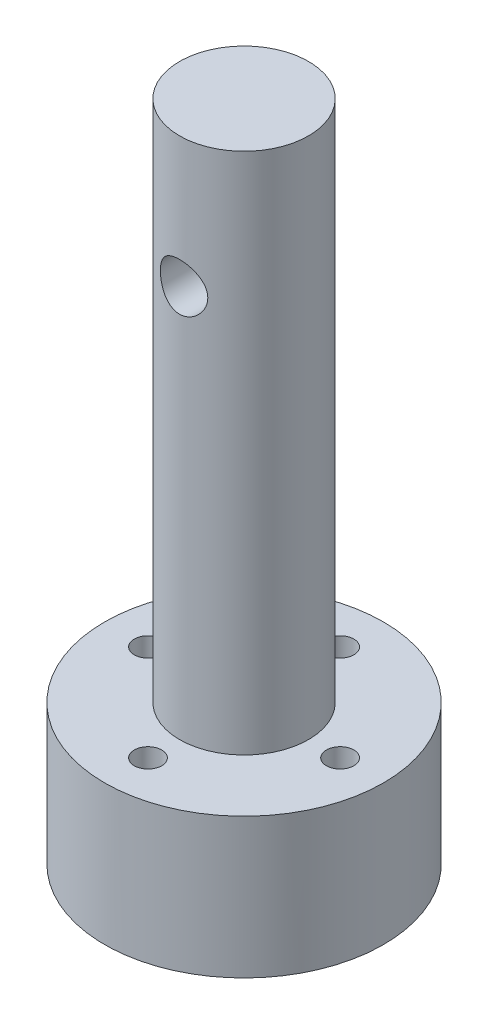
ISO-10303-21;
HEADER;
FILE_DESCRIPTION(('STEP AP214'),'2;1');
FILE_NAME('part.step','',(''),(''),'','','');
FILE_SCHEMA(('AUTOMOTIVE_DESIGN { 1 0 10303 214 1 1 1 1 }'));
ENDSEC;
DATA;
#1=APPLICATION_CONTEXT('core data for automotive mechanical design processes');
#2=APPLICATION_PROTOCOL_DEFINITION('international standard','automotive_design',2000,#1);
#3=PRODUCT_CONTEXT('',#1,'mechanical');
#4=PRODUCT('Part','Part','',(#3));
#5=PRODUCT_RELATED_PRODUCT_CATEGORY('part','',(#4));
#6=PRODUCT_DEFINITION_FORMATION('','',#4);
#7=PRODUCT_DEFINITION_CONTEXT('part definition',#1,'design');
#8=PRODUCT_DEFINITION('design','',#6,#7);
#9=PRODUCT_DEFINITION_SHAPE('','',#8);
#10=(LENGTH_UNIT() NAMED_UNIT(*) SI_UNIT(.MILLI.,.METRE.));
#11=(NAMED_UNIT(*) PLANE_ANGLE_UNIT() SI_UNIT($,.RADIAN.));
#12=(NAMED_UNIT(*) SI_UNIT($,.STERADIAN.) SOLID_ANGLE_UNIT());
#13=UNCERTAINTY_MEASURE_WITH_UNIT(LENGTH_MEASURE(1.E-05),#10,'distance_accuracy_value','');
#14=(GEOMETRIC_REPRESENTATION_CONTEXT(3) GLOBAL_UNCERTAINTY_ASSIGNED_CONTEXT((#13)) GLOBAL_UNIT_ASSIGNED_CONTEXT((#10,
#11,#12)) REPRESENTATION_CONTEXT('',''));
#15=CARTESIAN_POINT('',(0.,0.,0.));
#16=DIRECTION('',(0.,0.,1.));
#17=DIRECTION('',(1.,0.,0.));
#18=AXIS2_PLACEMENT_3D('',#15,#16,#17);
#19=CARTESIAN_POINT('',(0.,19.05,0.));
#20=DIRECTION('',(0.,-1.,0.));
#21=DIRECTION('',(0.,0.,-1.));
#22=AXIS2_PLACEMENT_3D('',#19,#20,#21);
#23=CYLINDRICAL_SURFACE('',#22,10.16);
#24=CARTESIAN_POINT('',(0.,19.05,0.));
#25=DIRECTION('',(0.,1.,0.));
#26=DIRECTION('',(0.,0.,1.));
#27=AXIS2_PLACEMENT_3D('',#24,#25,#26);
#28=CIRCLE('',#27,10.16);
#29=CARTESIAN_POINT('',(0.,19.05,10.16));
#30=VERTEX_POINT('',#29);
#31=EDGE_CURVE('E10',#30,#30,#28,.T.);
#32=ORIENTED_EDGE('',*,*,#31,.F.);
#33=EDGE_LOOP('',(#32));
#34=FACE_BOUND('',#33,.T.);
#35=CARTESIAN_POINT('',(0.,8.842000096,0.));
#36=DIRECTION('',(0.,-1.,0.));
#37=DIRECTION('',(0.,0.,-1.));
#38=AXIS2_PLACEMENT_3D('',#35,#36,#37);
#39=CIRCLE('',#38,10.16);
#40=CARTESIAN_POINT('',(0.,8.842000096,-10.16));
#41=VERTEX_POINT('',#40);
#42=EDGE_CURVE('E61',#41,#41,#39,.T.);
#43=ORIENTED_EDGE('',*,*,#42,.F.);
#44=EDGE_LOOP('',(#43));
#45=FACE_BOUND('',#44,.T.);
#46=ADVANCED_FACE('F37',(#34,#45),#23,.T.);
#47=CARTESIAN_POINT('',(6.99999997,19.05,0.));
#48=DIRECTION('',(0.,-1.,0.));
#49=DIRECTION('',(0.,0.,-1.));
#50=AXIS2_PLACEMENT_3D('',#47,#48,#49);
#51=CYLINDRICAL_SURFACE('',#50,1.000000032);
#52=CARTESIAN_POINT('',(6.99999997,19.05,0.));
#53=DIRECTION('',(0.,1.,0.));
#54=DIRECTION('',(0.,0.,1.));
#55=AXIS2_PLACEMENT_3D('',#52,#53,#54);
#56=CIRCLE('',#55,1.000000032);
#57=CARTESIAN_POINT('',(6.99999997,19.05,1.000000032));
#58=VERTEX_POINT('',#57);
#59=EDGE_CURVE('E49',#58,#58,#56,.T.);
#60=ORIENTED_EDGE('',*,*,#59,.T.);
#61=EDGE_LOOP('',(#60));
#62=FACE_BOUND('',#61,.T.);
#63=CARTESIAN_POINT('',(6.99999997,8.842000096,0.));
#64=DIRECTION('',(0.,-1.,0.));
#65=DIRECTION('',(0.,0.,-1.));
#66=AXIS2_PLACEMENT_3D('',#63,#64,#65);
#67=CIRCLE('',#66,1.000000032);
#68=CARTESIAN_POINT('',(6.99999997,8.842000096,-1.000000032));
#69=VERTEX_POINT('',#68);
#70=EDGE_CURVE('E123',#69,#69,#67,.T.);
#71=ORIENTED_EDGE('',*,*,#70,.T.);
#72=EDGE_LOOP('',(#71));
#73=FACE_BOUND('',#72,.T.);
#74=ADVANCED_FACE('F99',(#62,#73),#51,.F.);
#75=CARTESIAN_POINT('',(0.,19.05,6.99999997));
#76=DIRECTION('',(0.,-1.,0.));
#77=DIRECTION('',(0.,0.,-1.));
#78=AXIS2_PLACEMENT_3D('',#75,#76,#77);
#79=CYLINDRICAL_SURFACE('',#78,1.000000032);
#80=CARTESIAN_POINT('',(0.,19.05,6.99999997));
#81=DIRECTION('',(0.,1.,0.));
#82=DIRECTION('',(0.,0.,1.));
#83=AXIS2_PLACEMENT_3D('',#80,#81,#82);
#84=CIRCLE('',#83,1.000000032);
#85=CARTESIAN_POINT('',(0.,19.05,8.000000002));
#86=VERTEX_POINT('',#85);
#87=EDGE_CURVE('E54',#86,#86,#84,.T.);
#88=ORIENTED_EDGE('',*,*,#87,.T.);
#89=EDGE_LOOP('',(#88));
#90=FACE_BOUND('',#89,.T.);
#91=CARTESIAN_POINT('',(0.,8.842000096,6.99999997));
#92=DIRECTION('',(0.,-1.,0.));
#93=DIRECTION('',(0.,0.,-1.));
#94=AXIS2_PLACEMENT_3D('',#91,#92,#93);
#95=CIRCLE('',#94,1.000000032);
#96=CARTESIAN_POINT('',(0.,8.842000096,5.999999938));
#97=VERTEX_POINT('',#96);
#98=EDGE_CURVE('E120',#97,#97,#95,.T.);
#99=ORIENTED_EDGE('',*,*,#98,.T.);
#100=EDGE_LOOP('',(#99));
#101=FACE_BOUND('',#100,.T.);
#102=ADVANCED_FACE('F104',(#90,#101),#79,.F.);
#103=CARTESIAN_POINT('',(-6.99999997,19.05,0.));
#104=DIRECTION('',(0.,-1.,0.));
#105=DIRECTION('',(0.,0.,-1.));
#106=AXIS2_PLACEMENT_3D('',#103,#104,#105);
#107=CYLINDRICAL_SURFACE('',#106,1.000000032);
#108=CARTESIAN_POINT('',(-6.99999997,19.05,0.));
#109=DIRECTION('',(0.,1.,0.));
#110=DIRECTION('',(0.,0.,1.));
#111=AXIS2_PLACEMENT_3D('',#108,#109,#110);
#112=CIRCLE('',#111,1.000000032);
#113=CARTESIAN_POINT('',(-6.99999997,19.05,1.000000032));
#114=VERTEX_POINT('',#113);
#115=EDGE_CURVE('E134',#114,#114,#112,.T.);
#116=ORIENTED_EDGE('',*,*,#115,.T.);
#117=EDGE_LOOP('',(#116));
#118=FACE_BOUND('',#117,.T.);
#119=CARTESIAN_POINT('',(-6.99999997,8.842000096,0.));
#120=DIRECTION('',(0.,-1.,0.));
#121=DIRECTION('',(0.,0.,-1.));
#122=AXIS2_PLACEMENT_3D('',#119,#120,#121);
#123=CIRCLE('',#122,1.000000032);
#124=CARTESIAN_POINT('',(-6.99999997,8.842000096,-1.000000032));
#125=VERTEX_POINT('',#124);
#126=EDGE_CURVE('E60',#125,#125,#123,.T.);
#127=ORIENTED_EDGE('',*,*,#126,.T.);
#128=EDGE_LOOP('',(#127));
#129=FACE_BOUND('',#128,.T.);
#130=ADVANCED_FACE('F148',(#118,#129),#107,.F.);
#131=CARTESIAN_POINT('',(0.,19.05,-6.99999997));
#132=DIRECTION('',(0.,-1.,0.));
#133=DIRECTION('',(0.,0.,-1.));
#134=AXIS2_PLACEMENT_3D('',#131,#132,#133);
#135=CYLINDRICAL_SURFACE('',#134,1.000000032);
#136=CARTESIAN_POINT('',(0.,19.05,-6.99999997));
#137=DIRECTION('',(0.,1.,0.));
#138=DIRECTION('',(0.,0.,1.));
#139=AXIS2_PLACEMENT_3D('',#136,#137,#138);
#140=CIRCLE('',#139,1.000000032);
#141=CARTESIAN_POINT('',(0.,19.05,-5.999999938));
#142=VERTEX_POINT('',#141);
#143=EDGE_CURVE('E129',#142,#142,#140,.T.);
#144=ORIENTED_EDGE('',*,*,#143,.T.);
#145=EDGE_LOOP('',(#144));
#146=FACE_BOUND('',#145,.T.);
#147=CARTESIAN_POINT('',(0.,8.842000096,-6.99999997));
#148=DIRECTION('',(0.,-1.,0.));
#149=DIRECTION('',(0.,0.,-1.));
#150=AXIS2_PLACEMENT_3D('',#147,#148,#149);
#151=CIRCLE('',#150,1.000000032);
#152=CARTESIAN_POINT('',(0.,8.842000096,-8.000000002));
#153=VERTEX_POINT('',#152);
#154=EDGE_CURVE('E58',#153,#153,#151,.T.);
#155=ORIENTED_EDGE('',*,*,#154,.T.);
#156=EDGE_LOOP('',(#155));
#157=FACE_BOUND('',#156,.T.);
#158=ADVANCED_FACE('F142',(#146,#157),#135,.F.);
#159=CARTESIAN_POINT('',(0.,19.05,0.));
#160=DIRECTION('',(0.,1.,0.));
#161=DIRECTION('',(0.,0.,1.));
#162=AXIS2_PLACEMENT_3D('',#159,#160,#161);
#163=PLANE('',#162);
#164=CARTESIAN_POINT('',(0.,19.05,0.));
#165=DIRECTION('',(0.,1.,0.));
#166=DIRECTION('',(0.,0.,1.));
#167=AXIS2_PLACEMENT_3D('',#164,#165,#166);
#168=CIRCLE('',#167,4.699);
#169=CARTESIAN_POINT('',(0.,19.05,4.699));
#170=VERTEX_POINT('',#169);
#171=EDGE_CURVE('E126',#170,#170,#168,.T.);
#172=ORIENTED_EDGE('',*,*,#171,.F.);
#173=EDGE_LOOP('',(#172));
#174=FACE_BOUND('',#173,.T.);
#175=ORIENTED_EDGE('',*,*,#115,.F.);
#176=EDGE_LOOP('',(#175));
#177=FACE_BOUND('',#176,.T.);
#178=ORIENTED_EDGE('',*,*,#59,.F.);
#179=EDGE_LOOP('',(#178));
#180=FACE_BOUND('',#179,.T.);
#181=ORIENTED_EDGE('',*,*,#31,.T.);
#182=EDGE_LOOP('',(#181));
#183=FACE_BOUND('',#182,.T.);
#184=ORIENTED_EDGE('',*,*,#87,.F.);
#185=EDGE_LOOP('',(#184));
#186=FACE_BOUND('',#185,.T.);
#187=ORIENTED_EDGE('',*,*,#143,.F.);
#188=EDGE_LOOP('',(#187));
#189=FACE_BOUND('',#188,.T.);
#190=ADVANCED_FACE('F96',(#174,#177,#180,#183,#186,#189),#163,.T.);
#191=CARTESIAN_POINT('',(0.,57.15,0.));
#192=DIRECTION('',(0.,-1.,0.));
#193=DIRECTION('',(0.,0.,-1.));
#194=AXIS2_PLACEMENT_3D('',#191,#192,#193);
#195=CYLINDRICAL_SURFACE('',#194,4.699);
#196=CARTESIAN_POINT('',(0.,49.351999975,-4.699));
#197=CARTESIAN_POINT('',(-0.0936597037852148,49.3520027050608,-4.69900201406208));
#198=CARTESIAN_POINT('',(-0.187300353649841,49.3443568369589,-4.69617513589366));
#199=CARTESIAN_POINT('',(-0.371790415939551,49.3140934217951,-4.68517985750272));
#200=CARTESIAN_POINT('',(-0.462640106307822,49.2914773706591,-4.67701199099024));
#201=CARTESIAN_POINT('',(-0.638861385790737,49.2321765708706,-4.65621352067992));
#202=CARTESIAN_POINT('',(-0.724242933184116,49.195518297706,-4.64359131868078));
#203=CARTESIAN_POINT('',(-0.887640162923152,49.109305517478,-4.61514708837314));
#204=CARTESIAN_POINT('',(-0.965653948098185,49.0597477011037,-4.5993242391877));
#205=CARTESIAN_POINT('',(-1.1153026538153,48.9470161403301,-4.56539243571129));
#206=CARTESIAN_POINT('',(-1.18659482701979,48.8834065098059,-4.54722056357687));
#207=CARTESIAN_POINT('',(-1.31777324926791,48.7453024247081,-4.51095500019306));
#208=CARTESIAN_POINT('',(-1.3776562043538,48.6708048376071,-4.49286133299131));
#209=CARTESIAN_POINT('',(-1.48645319554568,48.5097403380253,-4.45807638673338));
#210=CARTESIAN_POINT('',(-1.53489035805515,48.4228335630722,-4.44145981980174));
#211=CARTESIAN_POINT('',(-1.6163093949441,48.2413997198293,-4.41248529622556));
#212=CARTESIAN_POINT('',(-1.64929716543559,48.1468755748044,-4.40012571542042));
#213=CARTESIAN_POINT('',(-1.69754033807888,47.9568282892078,-4.38173531998925));
#214=CARTESIAN_POINT('',(-1.71344784736466,47.8614938569927,-4.37547268935191));
#215=CARTESIAN_POINT('',(-1.72911803237695,47.6693189355832,-4.36930541864155));
#216=CARTESIAN_POINT('',(-1.72888704231209,47.5724790521846,-4.36939828409602));
#217=CARTESIAN_POINT('',(-1.71278683594155,47.3859288471003,-4.37573101657493));
#218=CARTESIAN_POINT('',(-1.69781165296679,47.2961272498713,-4.38161945436606));
#219=CARTESIAN_POINT('',(-1.65412247561402,47.1204141409925,-4.3982974938618));
#220=CARTESIAN_POINT('',(-1.62540649487765,47.0345031937381,-4.40908780416563));
#221=CARTESIAN_POINT('',(-1.55454282515076,46.8671493539749,-4.43457243808094));
#222=CARTESIAN_POINT('',(-1.51215722290486,46.7858180631241,-4.44933508176647));
#223=CARTESIAN_POINT('',(-1.41532312856777,46.6311586281697,-4.48107715891017));
#224=CARTESIAN_POINT('',(-1.36087058980329,46.5578331811855,-4.49805733523635));
#225=CARTESIAN_POINT('',(-1.23732018198222,46.4163033926303,-4.53365477918216));
#226=CARTESIAN_POINT('',(-1.16750535680454,46.3487322536993,-4.5523070791091));
#227=CARTESIAN_POINT('',(-1.0173168949606,46.2260729154535,-4.58820470778322));
#228=CARTESIAN_POINT('',(-0.936941763658764,46.1709864861544,-4.60544983680765));
#229=CARTESIAN_POINT('',(-0.766350524643162,46.0741985726765,-4.63690920131285));
#230=CARTESIAN_POINT('',(-0.676009907740511,46.0327001926866,-4.65107646612188));
#231=CARTESIAN_POINT('',(-0.48898021092089,45.9656980963627,-4.6744370340393));
#232=CARTESIAN_POINT('',(-0.392293854189405,45.9401875680071,-4.68363245529569));
#233=CARTESIAN_POINT('',(-0.200652324124451,45.9070846227449,-4.69564491975935));
#234=CARTESIAN_POINT('',(-0.105863395383269,45.8986390117532,-4.69876537591916));
#235=CARTESIAN_POINT('',(0.083817211132235,45.8974313968649,-4.6992087658032));
#236=CARTESIAN_POINT('',(0.178708862946363,45.9046660775091,-4.6965329251033));
#237=CARTESIAN_POINT('',(0.362265571442448,45.9339597306528,-4.68588475428974));
#238=CARTESIAN_POINT('',(0.45103140700968,45.9554664121563,-4.678109871093));
#239=CARTESIAN_POINT('',(0.623637635043317,46.0119732905177,-4.6582432955655));
#240=CARTESIAN_POINT('',(0.707477384981748,46.0469752431322,-4.64615104155295));
#241=CARTESIAN_POINT('',(0.870565888861129,46.1305824039038,-4.61841528921575));
#242=CARTESIAN_POINT('',(0.949611745140982,46.1795517502633,-4.60267920085735));
#243=CARTESIAN_POINT('',(1.09862421792286,46.2892893009176,-4.5694052648855));
#244=CARTESIAN_POINT('',(1.1685875640788,46.3500617356073,-4.55186677232913));
#245=CARTESIAN_POINT('',(1.30152018438775,46.485666209531,-4.51571207106199));
#246=CARTESIAN_POINT('',(1.36388310683826,46.5610926854568,-4.49709023005378));
#247=CARTESIAN_POINT('',(1.47517796037886,46.7217144131976,-4.46182355780699));
#248=CARTESIAN_POINT('',(1.5241089318445,46.8069103623611,-4.44517886787099));
#249=CARTESIAN_POINT('',(1.60713768633697,46.9852109337145,-4.41584244415583));
#250=CARTESIAN_POINT('',(1.64119394836886,47.078336837597,-4.40316180321001));
#251=CARTESIAN_POINT('',(1.69293068780905,47.2695941076406,-4.38353364459759));
#252=CARTESIAN_POINT('',(1.71062075517822,47.3677225069166,-4.37658276976894));
#253=CARTESIAN_POINT('',(1.72828459177033,47.5596584989626,-4.36963554317483));
#254=CARTESIAN_POINT('',(1.7292870569404,47.6533576412916,-4.3692354028493));
#255=CARTESIAN_POINT('',(1.71616345950525,47.8395135049541,-4.37440655796409));
#256=CARTESIAN_POINT('',(1.70203871751499,47.9319703340289,-4.37997733213975));
#257=CARTESIAN_POINT('',(1.65985015949339,48.1103839437193,-4.39613275335512));
#258=CARTESIAN_POINT('',(1.6321898621513,48.1964504306407,-4.40657186680266));
#259=CARTESIAN_POINT('',(1.5640648599172,48.3627750689195,-4.43120838347953));
#260=CARTESIAN_POINT('',(1.5235969809405,48.4430317743823,-4.4454067182086));
#261=CARTESIAN_POINT('',(1.42861288592956,48.5998969166671,-4.47686128410273));
#262=CARTESIAN_POINT('',(1.3734865118398,48.6761117954357,-4.49423636763509));
#263=CARTESIAN_POINT('',(1.25171062199739,48.8185386598103,-4.52966212502821));
#264=CARTESIAN_POINT('',(1.18505751853967,48.8847475189745,-4.54771300785745));
#265=CARTESIAN_POINT('',(1.03804207574102,49.0087286574486,-4.58356539626735));
#266=CARTESIAN_POINT('',(0.957152945977548,49.065896294485,-4.60130693477539));
#267=CARTESIAN_POINT('',(0.786297100171885,49.1657974508898,-4.63356100886307));
#268=CARTESIAN_POINT('',(0.696330279733312,49.2085308042346,-4.64807350730155));
#269=CARTESIAN_POINT('',(0.50728129872503,49.2789746366682,-4.67253423294187));
#270=CARTESIAN_POINT('',(0.408020005921134,49.3062539857234,-4.68235038555204));
#271=CARTESIAN_POINT('',(0.205830356337546,49.3427610771035,-4.69558071640599));
#272=CARTESIAN_POINT('',(0.10290367783118,49.3519969754892,-4.69899778715512));
#273=CARTESIAN_POINT('',(0.,49.351999975,-4.699));
#274=B_SPLINE_CURVE_WITH_KNOTS('',3,(#196,#197,#198,#199,#200,#201,#202,#203,#204,#205,#206,
#207,#208,#209,#210,#211,#212,#213,#214,#215,#216,#217,#218,#219,#220,#221,#222,#223,#224,#225,
#226,#227,#228,#229,#230,#231,#232,#233,#234,#235,#236,#237,#238,#239,#240,#241,#242,#243,#244,
#245,#246,#247,#248,#249,#250,#251,#252,#253,#254,#255,#256,#257,#258,#259,#260,#261,#262,#263,
#264,#265,#266,#267,#268,#269,#270,#271,#272,#273),.UNSPECIFIED.,.T.,.F.,(4,2,2,2,2,2,2,2,2,2,2,
2,2,2,2,2,2,2,2,2,2,2,2,2,2,2,2,2,2,2,2,2,2,2,2,2,2,2,4),(0.,0.28059970664039,0.561171378019844,
0.84121663713962,1.12133381134853,1.41181367217713,1.70237727084358,2.0034844326114,
2.30447658589344,2.59351688493328,2.88244373902208,3.15486664488274,3.42732894387616,
3.70481538057506,3.98239501415218,4.27783736454713,4.5733215750243,4.87303979753897,
5.17263023068007,5.45682953123798,5.74096874622521,6.01470789919282,6.28848267809129,
6.5701751775019,6.85196882645756,7.14945307059025,7.44695856248501,7.74528927951707,
8.04344507529475,8.32314812801859,8.60282676447536,8.87463356738563,9.14650778460619,
9.432218819127,9.71801894204979,10.0184356269879,10.318855767209,10.6272894011958,
10.9355835836957),.UNSPECIFIED.);
#275=CARTESIAN_POINT('',(0.,49.351999975,-4.699));
#276=VERTEX_POINT('',#275);
#277=EDGE_CURVE('E40',#276,#276,#274,.T.);
#278=ORIENTED_EDGE('',*,*,#277,.T.);
#279=EDGE_LOOP('',(#278));
#280=FACE_BOUND('',#279,.T.);
#281=CARTESIAN_POINT('',(1.726999975,47.625,4.37013410393205));
#282=CARTESIAN_POINT('',(1.7270028245118,47.5315822459463,4.3701315091441));
#283=CARTESIAN_POINT('',(1.7193948789356,47.4381837072698,4.37316207718253));
#284=CARTESIAN_POINT('',(1.68929586019043,47.2541935711758,4.384876027609));
#285=CARTESIAN_POINT('',(1.66680475294212,47.1636019801861,4.39355942294085));
#286=CARTESIAN_POINT('',(1.60786865097714,46.9879310105022,4.41546538988636));
#287=CARTESIAN_POINT('',(1.57145591441019,46.9028394165553,4.42867746072575));
#288=CARTESIAN_POINT('',(1.48582379260214,46.739940483151,4.4581355108366));
#289=CARTESIAN_POINT('',(1.43660072871357,46.6621352448044,4.4743823612045));
#290=CARTESIAN_POINT('',(1.32423017181217,46.5123060004493,4.50894788361541));
#291=CARTESIAN_POINT('',(1.26057140149558,46.4406790245312,4.52732584828137));
#292=CARTESIAN_POINT('',(1.12222245217891,46.3088392006195,4.56358705686371));
#293=CARTESIAN_POINT('',(1.04753004288366,46.2486286659313,4.58147019988909));
#294=CARTESIAN_POINT('',(0.886241093179257,46.1394394313089,4.61542815892491));
#295=CARTESIAN_POINT('',(0.799336553053366,46.090889383391,4.63142531131273));
#296=CARTESIAN_POINT('',(0.617902235288164,46.0092614333496,4.65909879823927));
#297=CARTESIAN_POINT('',(0.523375002291851,45.976178392821,4.67077656748144));
#298=CARTESIAN_POINT('',(0.333550619301035,45.9278073439052,4.68807480209679));
#299=CARTESIAN_POINT('',(0.238449010169282,45.9118364410909,4.6939269993867));
#300=CARTESIAN_POINT('',(0.0467474673928154,45.8959580699934,4.69974464571782));
#301=CARTESIAN_POINT('',(-0.049851988756427,45.8960455836342,4.69971193372761));
#302=CARTESIAN_POINT('',(-0.236923892482701,45.9118772023217,4.69391266849778));
#303=CARTESIAN_POINT('',(-0.327469267368628,45.9268766368537,4.6884188340031));
#304=CARTESIAN_POINT('',(-0.504654697330042,45.9708576573391,4.67266944187735));
#305=CARTESIAN_POINT('',(-0.591294476795846,45.9998402283694,4.66241354877308));
#306=CARTESIAN_POINT('',(-0.759682274843441,46.0713267699766,4.63797716792641));
#307=CARTESIAN_POINT('',(-0.841342289728123,46.1140187457342,4.62374249097434));
#308=CARTESIAN_POINT('',(-0.99653881599124,46.2115481981644,4.59279682959937));
#309=CARTESIAN_POINT('',(-1.0700727545156,46.2663895051024,4.57608506478713));
#310=CARTESIAN_POINT('',(-1.21132614745394,46.3902803759167,4.5408025281103));
#311=CARTESIAN_POINT('',(-1.27848361736708,46.4599569165493,4.52218006796205));
#312=CARTESIAN_POINT('',(-1.40036694776363,46.6097047369315,4.48593647517453));
#313=CARTESIAN_POINT('',(-1.45508993490367,46.6897784125331,4.46831557467826));
#314=CARTESIAN_POINT('',(-1.55156670985526,46.8601818121726,4.43575210789566));
#315=CARTESIAN_POINT('',(-1.59303038565171,46.9506887047014,4.42087213124117));
#316=CARTESIAN_POINT('',(-1.65991930074453,47.1380903840578,4.39619780842312));
#317=CARTESIAN_POINT('',(-1.68535304228761,47.2349817543963,4.38640076676889));
#318=CARTESIAN_POINT('',(-1.71820714237084,47.4268668407429,4.37363249556046));
#319=CARTESIAN_POINT('',(-1.72651647211995,47.5216858305445,4.37032486226999));
#320=CARTESIAN_POINT('',(-1.72744206538809,47.7114003269359,4.36995971089425));
#321=CARTESIAN_POINT('',(-1.72006203208819,47.8062958101861,4.37290071793405));
#322=CARTESIAN_POINT('',(-1.69062323279057,47.9890105492795,4.38436093323881));
#323=CARTESIAN_POINT('',(-1.66923808247526,48.0769562492546,4.39262387974721));
#324=CARTESIAN_POINT('',(-1.61323619490996,48.2479755041782,4.4134970952167));
#325=CARTESIAN_POINT('',(-1.57861681210928,48.331048081147,4.4261082333409));
#326=CARTESIAN_POINT('',(-1.49570458679985,48.4933325537346,4.45482380352308));
#327=CARTESIAN_POINT('',(-1.44695881202005,48.5722928853833,4.47103893331149));
#328=CARTESIAN_POINT('',(-1.33766506506111,48.721229936064,4.5049442362246));
#329=CARTESIAN_POINT('',(-1.27711292298713,48.7912034665188,4.52263492923707));
#330=CARTESIAN_POINT('',(-1.14159078280224,48.9245659302391,4.55879074166151));
#331=CARTESIAN_POINT('',(-1.06597046390972,48.98730106107,4.57723802378127));
#332=CARTESIAN_POINT('',(-0.904821601857981,49.0992627559815,4.61179797754954));
#333=CARTESIAN_POINT('',(-0.819293115930635,49.1484893980846,4.62791066268201));
#334=CARTESIAN_POINT('',(-0.640894813110356,49.2316810570137,4.6559600515639));
#335=CARTESIAN_POINT('',(-0.548057494383735,49.2657095913525,4.66791408832006));
#336=CARTESIAN_POINT('',(-0.35743943185054,49.3174857195134,4.68636190370948));
#337=CARTESIAN_POINT('',(-0.259660929051042,49.3352406253239,4.69285813450825));
#338=CARTESIAN_POINT('',(-0.0678578012441938,49.3532005470786,4.69943473747872));
#339=CARTESIAN_POINT('',(0.0260688381593414,49.3543360597914,4.69985526192447));
#340=CARTESIAN_POINT('',(0.212715538577593,49.3414000990817,4.69511073174567));
#341=CARTESIAN_POINT('',(0.305435734355753,49.327330339152,4.68994630649299));
#342=CARTESIAN_POINT('',(0.484907882092746,49.285031457955,4.6747621640387));
#343=CARTESIAN_POINT('',(0.571747511938287,49.2571308069592,4.66485525530202));
#344=CARTESIAN_POINT('',(0.739525555386856,49.1882844398017,4.64121625455579));
#345=CARTESIAN_POINT('',(0.820462851330584,49.1473362608163,4.62748344043801));
#346=CARTESIAN_POINT('',(0.977791847051952,49.0516312875784,4.59686991763918));
#347=CARTESIAN_POINT('',(1.0538583898288,48.9963746276929,4.57988273788577));
#348=CARTESIAN_POINT('',(1.19593030034421,48.8744203868575,4.54485588063823));
#349=CARTESIAN_POINT('',(1.26193212209082,48.8077187911487,4.52681583528061));
#350=CARTESIAN_POINT('',(1.38540353230743,48.6607832386736,4.49061331092082));
#351=CARTESIAN_POINT('',(1.44227859371402,48.5800381014121,4.47249013420934));
#352=CARTESIAN_POINT('',(1.54166296104843,48.4095619825928,4.43921547127957));
#353=CARTESIAN_POINT('',(1.58417184915243,48.3198307397827,4.42406407149741));
#354=CARTESIAN_POINT('',(1.65427615458943,48.1312424786094,4.39834264740411));
#355=CARTESIAN_POINT('',(1.68143916056885,48.0322047876553,4.38790697612367));
#356=CARTESIAN_POINT('',(1.71779421332222,47.8304355146748,4.37380612412168));
#357=CARTESIAN_POINT('',(1.72699684216543,47.7277061441101,4.37013695671596));
#358=CARTESIAN_POINT('',(1.726999975,47.625,4.37013410393205));
#359=B_SPLINE_CURVE_WITH_KNOTS('',3,(#281,#282,#283,#284,#285,#286,#287,#288,#289,#290,#291,
#292,#293,#294,#295,#296,#297,#298,#299,#300,#301,#302,#303,#304,#305,#306,#307,#308,#309,#310,
#311,#312,#313,#314,#315,#316,#317,#318,#319,#320,#321,#322,#323,#324,#325,#326,#327,#328,#329,
#330,#331,#332,#333,#334,#335,#336,#337,#338,#339,#340,#341,#342,#343,#344,#345,#346,#347,#348,
#349,#350,#351,#352,#353,#354,#355,#356,#357,#358),.UNSPECIFIED.,.T.,.F.,(4,2,2,2,2,2,2,2,2,2,2,
2,2,2,2,2,2,2,2,2,2,2,2,2,2,2,2,2,2,2,2,2,2,2,2,2,2,2,4),(0.,0.279871200239832,
0.559743041328754,0.838970276678961,1.11827778430626,1.40969773825381,1.70117667946298,
2.00212907135048,2.30298141052493,2.59132082682873,2.8795701404347,3.15411316744266,
3.42867553814445,3.70717660794764,3.98576560480564,4.28006976712358,4.57444186784264,
4.87487270173157,5.17514405327914,5.45938911156512,5.74356708656342,6.01499172477297,
6.28647064973111,6.56785788966846,6.849344693477,7.14784861101723,7.44635080441582,
7.74359351757565,8.04070260951027,8.32110899840232,8.60148379139625,8.8754978136247,
9.14956358882868,9.43493289930741,9.72040251965911,10.020200487476,10.3200071738261,
10.6278870108376,10.9355853933908),.UNSPECIFIED.);
#360=CARTESIAN_POINT('',(1.726999975,47.625,4.37013410393205));
#361=VERTEX_POINT('',#360);
#362=EDGE_CURVE('E62',#361,#361,#359,.T.);
#363=ORIENTED_EDGE('',*,*,#362,.T.);
#364=EDGE_LOOP('',(#363));
#365=FACE_BOUND('',#364,.T.);
#366=CARTESIAN_POINT('',(0.,57.15,0.));
#367=DIRECTION('',(0.,1.,0.));
#368=DIRECTION('',(0.,0.,1.));
#369=AXIS2_PLACEMENT_3D('',#366,#367,#368);
#370=CIRCLE('',#369,4.699);
#371=CARTESIAN_POINT('',(0.,57.15,4.699));
#372=VERTEX_POINT('',#371);
#373=EDGE_CURVE('E127',#372,#372,#370,.T.);
#374=ORIENTED_EDGE('',*,*,#373,.F.);
#375=EDGE_LOOP('',(#374));
#376=FACE_BOUND('',#375,.T.);
#377=ORIENTED_EDGE('',*,*,#171,.T.);
#378=EDGE_LOOP('',(#377));
#379=FACE_BOUND('',#378,.T.);
#380=ADVANCED_FACE('F67',(#280,#365,#376,#379),#195,.T.);
#381=CARTESIAN_POINT('',(0.,57.15,0.));
#382=DIRECTION('',(0.,1.,0.));
#383=DIRECTION('',(0.,0.,1.));
#384=AXIS2_PLACEMENT_3D('',#381,#382,#383);
#385=PLANE('',#384);
#386=ORIENTED_EDGE('',*,*,#373,.T.);
#387=EDGE_LOOP('',(#386));
#388=FACE_BOUND('',#387,.T.);
#389=ADVANCED_FACE('F87',(#388),#385,.T.);
#390=CARTESIAN_POINT('',(0.,8.842000096,0.));
#391=DIRECTION('',(0.,-1.,0.));
#392=DIRECTION('',(0.,0.,-1.));
#393=AXIS2_PLACEMENT_3D('',#390,#391,#392);
#394=PLANE('',#393);
#395=CARTESIAN_POINT('',(0.,8.842000096,0.));
#396=DIRECTION('',(0.,-1.,0.));
#397=DIRECTION('',(0.,0.,-1.));
#398=AXIS2_PLACEMENT_3D('',#395,#396,#397);
#399=CIRCLE('',#398,3.429);
#400=CARTESIAN_POINT('',(0.,8.842000096,-3.429));
#401=VERTEX_POINT('',#400);
#402=EDGE_CURVE('E114',#401,#401,#399,.T.);
#403=ORIENTED_EDGE('',*,*,#402,.F.);
#404=EDGE_LOOP('',(#403));
#405=FACE_BOUND('',#404,.T.);
#406=ORIENTED_EDGE('',*,*,#70,.F.);
#407=EDGE_LOOP('',(#406));
#408=FACE_BOUND('',#407,.T.);
#409=ORIENTED_EDGE('',*,*,#98,.F.);
#410=EDGE_LOOP('',(#409));
#411=FACE_BOUND('',#410,.T.);
#412=ORIENTED_EDGE('',*,*,#126,.F.);
#413=EDGE_LOOP('',(#412));
#414=FACE_BOUND('',#413,.T.);
#415=ORIENTED_EDGE('',*,*,#154,.F.);
#416=EDGE_LOOP('',(#415));
#417=FACE_BOUND('',#416,.T.);
#418=ORIENTED_EDGE('',*,*,#42,.T.);
#419=EDGE_LOOP('',(#418));
#420=FACE_BOUND('',#419,.T.);
#421=ADVANCED_FACE('F84',(#405,#408,#411,#414,#417,#420),#394,.T.);
#422=CARTESIAN_POINT('',(0.,12.017000096,0.));
#423=DIRECTION('',(0.,-1.,0.));
#424=DIRECTION('',(0.,0.,-1.));
#425=AXIS2_PLACEMENT_3D('',#422,#423,#424);
#426=CYLINDRICAL_SURFACE('',#425,3.429);
#427=CARTESIAN_POINT('',(0.,12.017000096,0.));
#428=DIRECTION('',(0.,-1.,0.));
#429=DIRECTION('',(0.,0.,-1.));
#430=AXIS2_PLACEMENT_3D('',#427,#428,#429);
#431=CIRCLE('',#430,3.429);
#432=CARTESIAN_POINT('',(0.,12.017000096,-3.429));
#433=VERTEX_POINT('',#432);
#434=EDGE_CURVE('E111',#433,#433,#431,.T.);
#435=ORIENTED_EDGE('',*,*,#434,.F.);
#436=EDGE_LOOP('',(#435));
#437=FACE_BOUND('',#436,.T.);
#438=ORIENTED_EDGE('',*,*,#402,.T.);
#439=EDGE_LOOP('',(#438));
#440=FACE_BOUND('',#439,.T.);
#441=ADVANCED_FACE('F80',(#437,#440),#426,.F.);
#442=CARTESIAN_POINT('',(0.,12.017000096,0.));
#443=DIRECTION('',(0.,-1.,0.));
#444=DIRECTION('',(0.,0.,-1.));
#445=AXIS2_PLACEMENT_3D('',#442,#443,#444);
#446=PLANE('',#445);
#447=ORIENTED_EDGE('',*,*,#434,.T.);
#448=EDGE_LOOP('',(#447));
#449=FACE_BOUND('',#448,.T.);
#450=ADVANCED_FACE('F75',(#449),#446,.T.);
#451=CARTESIAN_POINT('',(0.,47.625,-10.16));
#452=DIRECTION('',(0.,0.,1.));
#453=DIRECTION('',(1.,0.,0.));
#454=AXIS2_PLACEMENT_3D('',#451,#452,#453);
#455=CYLINDRICAL_SURFACE('',#454,1.726999975);
#456=ORIENTED_EDGE('',*,*,#362,.F.);
#457=EDGE_LOOP('',(#456));
#458=FACE_BOUND('',#457,.T.);
#459=ORIENTED_EDGE('',*,*,#277,.F.);
#460=EDGE_LOOP('',(#459));
#461=FACE_BOUND('',#460,.T.);
#462=ADVANCED_FACE('F71',(#458,#461),#455,.F.);
#463=CLOSED_SHELL('',(#46,#74,#102,#130,#158,#190,#380,#389,#421,#441,#450,#462));
#464=MANIFOLD_SOLID_BREP('B2',#463);
#465=ADVANCED_BREP_SHAPE_REPRESENTATION('',(#18,#464),#14);
#466=SHAPE_DEFINITION_REPRESENTATION(#9,#465);
ENDSEC;
END-ISO-10303-21;
